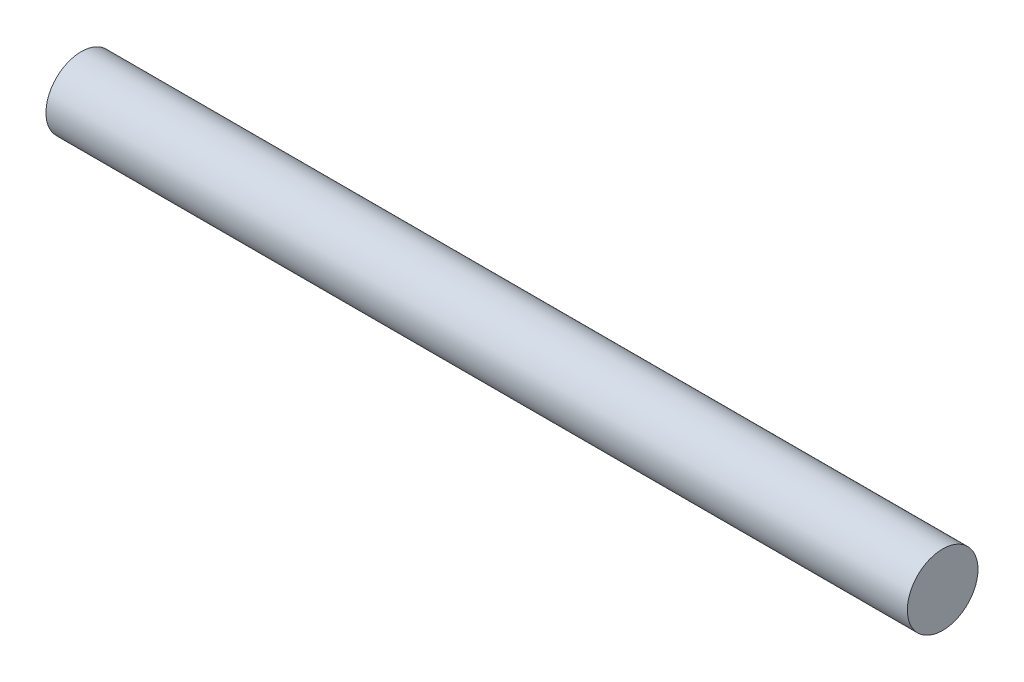
ISO-10303-21;
HEADER;
FILE_DESCRIPTION(('STEP AP214'),'2;1');
FILE_NAME('part.step','',(''),(''),'','','');
FILE_SCHEMA(('AUTOMOTIVE_DESIGN { 1 0 10303 214 1 1 1 1 }'));
ENDSEC;
DATA;
#1=APPLICATION_CONTEXT('core data for automotive mechanical design processes');
#2=APPLICATION_PROTOCOL_DEFINITION('international standard','automotive_design',2000,#1);
#3=PRODUCT_CONTEXT('',#1,'mechanical');
#4=PRODUCT('Part','Part','',(#3));
#5=PRODUCT_RELATED_PRODUCT_CATEGORY('part','',(#4));
#6=PRODUCT_DEFINITION_FORMATION('','',#4);
#7=PRODUCT_DEFINITION_CONTEXT('part definition',#1,'design');
#8=PRODUCT_DEFINITION('design','',#6,#7);
#9=PRODUCT_DEFINITION_SHAPE('','',#8);
#10=(LENGTH_UNIT() NAMED_UNIT(*) SI_UNIT(.MILLI.,.METRE.));
#11=(NAMED_UNIT(*) PLANE_ANGLE_UNIT() SI_UNIT($,.RADIAN.));
#12=(NAMED_UNIT(*) SI_UNIT($,.STERADIAN.) SOLID_ANGLE_UNIT());
#13=UNCERTAINTY_MEASURE_WITH_UNIT(LENGTH_MEASURE(1.E-05),#10,'distance_accuracy_value','');
#14=(GEOMETRIC_REPRESENTATION_CONTEXT(3) GLOBAL_UNCERTAINTY_ASSIGNED_CONTEXT((#13)) GLOBAL_UNIT_ASSIGNED_CONTEXT((#10,
#11,#12)) REPRESENTATION_CONTEXT('',''));
#15=CARTESIAN_POINT('',(0.,0.,0.));
#16=DIRECTION('',(0.,0.,1.));
#17=DIRECTION('',(1.,0.,0.));
#18=AXIS2_PLACEMENT_3D('',#15,#16,#17);
#19=CARTESIAN_POINT('',(97.5,0.,0.));
#20=DIRECTION('',(-1.,0.,0.));
#21=DIRECTION('',(0.,0.,1.));
#22=AXIS2_PLACEMENT_3D('',#19,#20,#21);
#23=CYLINDRICAL_SURFACE('',#22,4.);
#24=CARTESIAN_POINT('',(97.5,0.,0.));
#25=DIRECTION('',(1.,0.,0.));
#26=DIRECTION('',(0.,0.,-1.));
#27=AXIS2_PLACEMENT_3D('',#24,#25,#26);
#28=CIRCLE('',#27,4.);
#29=CARTESIAN_POINT('',(97.5,0.,-4.));
#30=VERTEX_POINT('',#29);
#31=EDGE_CURVE('E10',#30,#30,#28,.T.);
#32=ORIENTED_EDGE('',*,*,#31,.F.);
#33=EDGE_LOOP('',(#32));
#34=FACE_BOUND('',#33,.T.);
#35=CARTESIAN_POINT('',(0.,0.,0.));
#36=DIRECTION('',(1.,0.,0.));
#37=DIRECTION('',(0.,0.,-1.));
#38=AXIS2_PLACEMENT_3D('',#35,#36,#37);
#39=CIRCLE('',#38,4.);
#40=CARTESIAN_POINT('',(0.,0.,-4.));
#41=VERTEX_POINT('',#40);
#42=EDGE_CURVE('E34',#41,#41,#39,.T.);
#43=ORIENTED_EDGE('',*,*,#42,.T.);
#44=EDGE_LOOP('',(#43));
#45=FACE_BOUND('',#44,.T.);
#46=ADVANCED_FACE('F31',(#34,#45),#23,.T.);
#47=CARTESIAN_POINT('',(97.5,0.,0.));
#48=DIRECTION('',(1.,0.,0.));
#49=DIRECTION('',(0.,0.,-1.));
#50=AXIS2_PLACEMENT_3D('',#47,#48,#49);
#51=PLANE('',#50);
#52=ORIENTED_EDGE('',*,*,#31,.T.);
#53=EDGE_LOOP('',(#52));
#54=FACE_BOUND('',#53,.T.);
#55=ADVANCED_FACE('F46',(#54),#51,.T.);
#56=CARTESIAN_POINT('',(0.,0.,0.));
#57=DIRECTION('',(1.,0.,0.));
#58=DIRECTION('',(0.,0.,-1.));
#59=AXIS2_PLACEMENT_3D('',#56,#57,#58);
#60=PLANE('',#59);
#61=ORIENTED_EDGE('',*,*,#42,.F.);
#62=EDGE_LOOP('',(#61));
#63=FACE_BOUND('',#62,.T.);
#64=ADVANCED_FACE('F44',(#63),#60,.F.);
#65=CLOSED_SHELL('',(#46,#55,#64));
#66=MANIFOLD_SOLID_BREP('B2',#65);
#67=ADVANCED_BREP_SHAPE_REPRESENTATION('',(#18,#66),#14);
#68=SHAPE_DEFINITION_REPRESENTATION(#9,#67);
ENDSEC;
END-ISO-10303-21;
